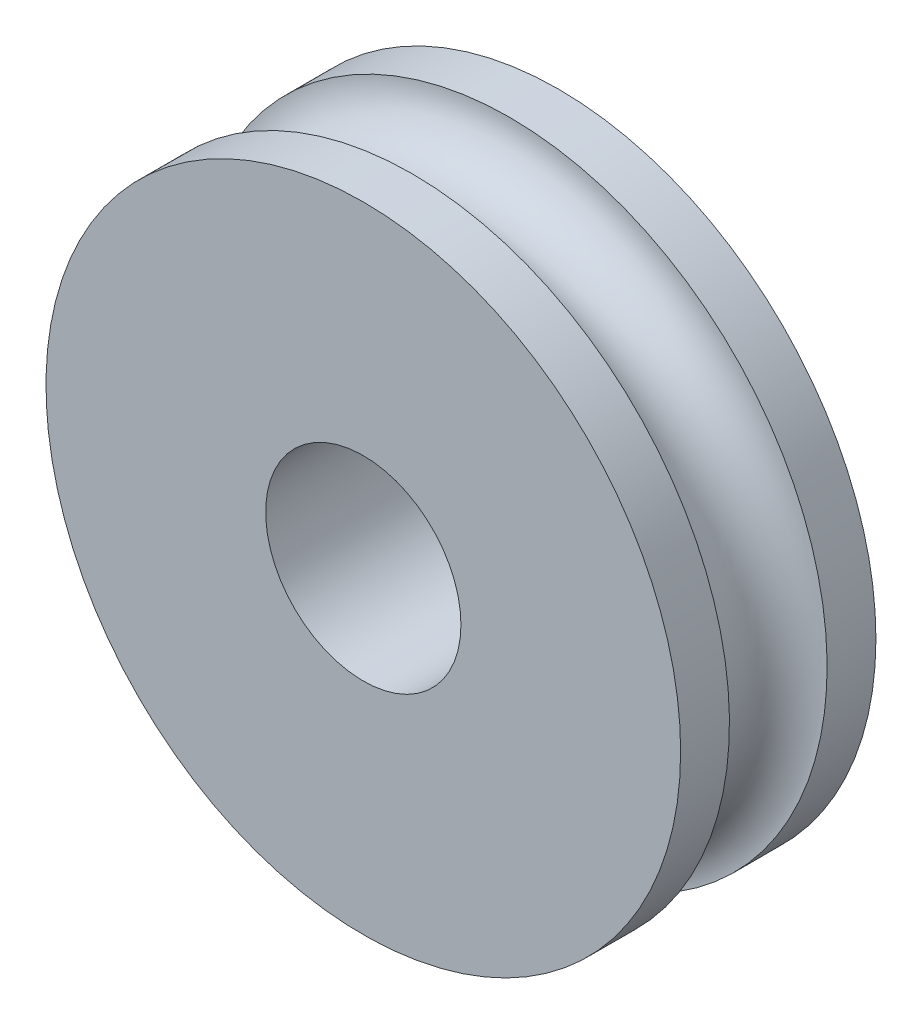
ISO-10303-21;
HEADER;
FILE_DESCRIPTION(('STEP AP214'),'2;1');
FILE_NAME('part.step','',(''),(''),'','','');
FILE_SCHEMA(('AUTOMOTIVE_DESIGN { 1 0 10303 214 1 1 1 1 }'));
ENDSEC;
DATA;
#1=APPLICATION_CONTEXT('core data for automotive mechanical design processes');
#2=APPLICATION_PROTOCOL_DEFINITION('international standard','automotive_design',2000,#1);
#3=PRODUCT_CONTEXT('',#1,'mechanical');
#4=PRODUCT('Part','Part','',(#3));
#5=PRODUCT_RELATED_PRODUCT_CATEGORY('part','',(#4));
#6=PRODUCT_DEFINITION_FORMATION('','',#4);
#7=PRODUCT_DEFINITION_CONTEXT('part definition',#1,'design');
#8=PRODUCT_DEFINITION('design','',#6,#7);
#9=PRODUCT_DEFINITION_SHAPE('','',#8);
#10=(LENGTH_UNIT() NAMED_UNIT(*) SI_UNIT(.MILLI.,.METRE.));
#11=(NAMED_UNIT(*) PLANE_ANGLE_UNIT() SI_UNIT($,.RADIAN.));
#12=(NAMED_UNIT(*) SI_UNIT($,.STERADIAN.) SOLID_ANGLE_UNIT());
#13=UNCERTAINTY_MEASURE_WITH_UNIT(LENGTH_MEASURE(1.E-05),#10,'distance_accuracy_value','');
#14=(GEOMETRIC_REPRESENTATION_CONTEXT(3) GLOBAL_UNCERTAINTY_ASSIGNED_CONTEXT((#13)) GLOBAL_UNIT_ASSIGNED_CONTEXT((#10,
#11,#12)) REPRESENTATION_CONTEXT('',''));
#15=CARTESIAN_POINT('',(0.,0.,0.));
#16=DIRECTION('',(0.,0.,1.));
#17=DIRECTION('',(1.,0.,0.));
#18=AXIS2_PLACEMENT_3D('',#15,#16,#17);
#19=CARTESIAN_POINT('',(0.,0.,4.));
#20=DIRECTION('',(0.,0.,-1.));
#21=DIRECTION('',(-1.,0.,0.));
#22=AXIS2_PLACEMENT_3D('',#19,#20,#21);
#23=CYLINDRICAL_SURFACE('',#22,6.5);
#24=CARTESIAN_POINT('',(0.,0.,4.));
#25=DIRECTION('',(0.,0.,1.));
#26=DIRECTION('',(1.,0.,0.));
#27=AXIS2_PLACEMENT_3D('',#24,#25,#26);
#28=CIRCLE('',#27,6.5);
#29=CARTESIAN_POINT('',(6.5,0.,4.));
#30=VERTEX_POINT('',#29);
#31=EDGE_CURVE('E58',#30,#30,#28,.T.);
#32=ORIENTED_EDGE('',*,*,#31,.F.);
#33=EDGE_LOOP('',(#32));
#34=FACE_BOUND('',#33,.T.);
#35=CARTESIAN_POINT('',(0.,0.,3.));
#36=DIRECTION('',(0.,0.,-1.));
#37=DIRECTION('',(-1.,0.,0.));
#38=AXIS2_PLACEMENT_3D('',#35,#36,#37);
#39=CIRCLE('',#38,6.5);
#40=CARTESIAN_POINT('',(0.,6.5,3.));
#41=VERTEX_POINT('',#40);
#42=EDGE_CURVE('E11',#41,#41,#39,.T.);
#43=ORIENTED_EDGE('',*,*,#42,.F.);
#44=EDGE_LOOP('',(#43));
#45=FACE_BOUND('',#44,.T.);
#46=ADVANCED_FACE('F32',(#34,#45),#23,.T.);
#47=CARTESIAN_POINT('',(0.,0.,0.));
#48=DIRECTION('',(0.,0.,1.));
#49=DIRECTION('',(1.,0.,0.));
#50=AXIS2_PLACEMENT_3D('',#47,#48,#49);
#51=CIRCLE('',#50,6.5);
#52=CARTESIAN_POINT('',(6.5,0.,0.));
#53=VERTEX_POINT('',#52);
#54=EDGE_CURVE('E56',#53,#53,#51,.T.);
#55=ORIENTED_EDGE('',*,*,#54,.T.);
#56=EDGE_LOOP('',(#55));
#57=FACE_BOUND('',#56,.T.);
#58=CARTESIAN_POINT('',(0.,0.,1.));
#59=DIRECTION('',(0.,0.,1.));
#60=DIRECTION('',(1.,0.,0.));
#61=AXIS2_PLACEMENT_3D('',#58,#59,#60);
#62=CIRCLE('',#61,6.5);
#63=CARTESIAN_POINT('',(0.,6.5,1.));
#64=VERTEX_POINT('',#63);
#65=EDGE_CURVE('E39',#64,#64,#62,.T.);
#66=ORIENTED_EDGE('',*,*,#65,.F.);
#67=EDGE_LOOP('',(#66));
#68=FACE_BOUND('',#67,.T.);
#69=ADVANCED_FACE('F64',(#57,#68),#23,.T.);
#70=CARTESIAN_POINT('',(0.,0.,4.));
#71=DIRECTION('',(0.,0.,1.));
#72=DIRECTION('',(1.,0.,0.));
#73=AXIS2_PLACEMENT_3D('',#70,#71,#72);
#74=PLANE('',#73);
#75=CARTESIAN_POINT('',(0.,0.,4.));
#76=DIRECTION('',(0.,0.,1.));
#77=DIRECTION('',(1.,0.,0.));
#78=AXIS2_PLACEMENT_3D('',#75,#76,#77);
#79=CIRCLE('',#78,2.);
#80=CARTESIAN_POINT('',(2.,0.,4.));
#81=VERTEX_POINT('',#80);
#82=EDGE_CURVE('E49',#81,#81,#79,.T.);
#83=ORIENTED_EDGE('',*,*,#82,.F.);
#84=EDGE_LOOP('',(#83));
#85=FACE_BOUND('',#84,.T.);
#86=ORIENTED_EDGE('',*,*,#31,.T.);
#87=EDGE_LOOP('',(#86));
#88=FACE_BOUND('',#87,.T.);
#89=ADVANCED_FACE('F70',(#85,#88),#74,.T.);
#90=CARTESIAN_POINT('',(0.,0.,0.));
#91=DIRECTION('',(0.,0.,1.));
#92=DIRECTION('',(1.,0.,0.));
#93=AXIS2_PLACEMENT_3D('',#90,#91,#92);
#94=PLANE('',#93);
#95=CARTESIAN_POINT('',(0.,0.,0.));
#96=DIRECTION('',(0.,0.,1.));
#97=DIRECTION('',(1.,0.,0.));
#98=AXIS2_PLACEMENT_3D('',#95,#96,#97);
#99=CIRCLE('',#98,2.);
#100=CARTESIAN_POINT('',(2.,0.,0.));
#101=VERTEX_POINT('',#100);
#102=EDGE_CURVE('E52',#101,#101,#99,.T.);
#103=ORIENTED_EDGE('',*,*,#102,.T.);
#104=EDGE_LOOP('',(#103));
#105=FACE_BOUND('',#104,.T.);
#106=ORIENTED_EDGE('',*,*,#54,.F.);
#107=EDGE_LOOP('',(#106));
#108=FACE_BOUND('',#107,.T.);
#109=ADVANCED_FACE('F67',(#105,#108),#94,.F.);
#110=CARTESIAN_POINT('',(0.,0.,0.));
#111=DIRECTION('',(0.,0.,1.));
#112=DIRECTION('',(1.,0.,0.));
#113=AXIS2_PLACEMENT_3D('',#110,#111,#112);
#114=CYLINDRICAL_SURFACE('',#113,2.);
#115=ORIENTED_EDGE('',*,*,#102,.F.);
#116=EDGE_LOOP('',(#115));
#117=FACE_BOUND('',#116,.T.);
#118=ORIENTED_EDGE('',*,*,#82,.T.);
#119=EDGE_LOOP('',(#118));
#120=FACE_BOUND('',#119,.T.);
#121=ADVANCED_FACE('F69',(#117,#120),#114,.F.);
#122=CARTESIAN_POINT('',(0.,0.,2.));
#123=DIRECTION('',(0.,0.,1.));
#124=DIRECTION('',(1.,0.,0.));
#125=AXIS2_PLACEMENT_3D('',#122,#123,#124);
#126=TOROIDAL_SURFACE('',#125,6.5,1.);
#127=ORIENTED_EDGE('',*,*,#42,.T.);
#128=CARTESIAN_POINT('',(0.,6.5,2.));
#129=DIRECTION('',(1.,0.,0.));
#130=DIRECTION('',(0.,0.,-1.));
#131=AXIS2_PLACEMENT_3D('',#128,#129,#130);
#132=CIRCLE('',#131,1.);
#133=EDGE_CURVE('E45',#41,#64,#132,.T.);
#134=ORIENTED_EDGE('',*,*,#133,.T.);
#135=ORIENTED_EDGE('',*,*,#65,.T.);
#136=ORIENTED_EDGE('',*,*,#133,.F.);
#137=EDGE_LOOP('',(#127,#134,#135,#136));
#138=FACE_BOUND('',#137,.T.);
#139=ADVANCED_FACE('F46',(#138),#126,.F.);
#140=CLOSED_SHELL('',(#46,#69,#89,#109,#121,#139));
#141=MANIFOLD_SOLID_BREP('B2',#140);
#142=ADVANCED_BREP_SHAPE_REPRESENTATION('',(#18,#141),#14);
#143=SHAPE_DEFINITION_REPRESENTATION(#9,#142);
ENDSEC;
END-ISO-10303-21;
